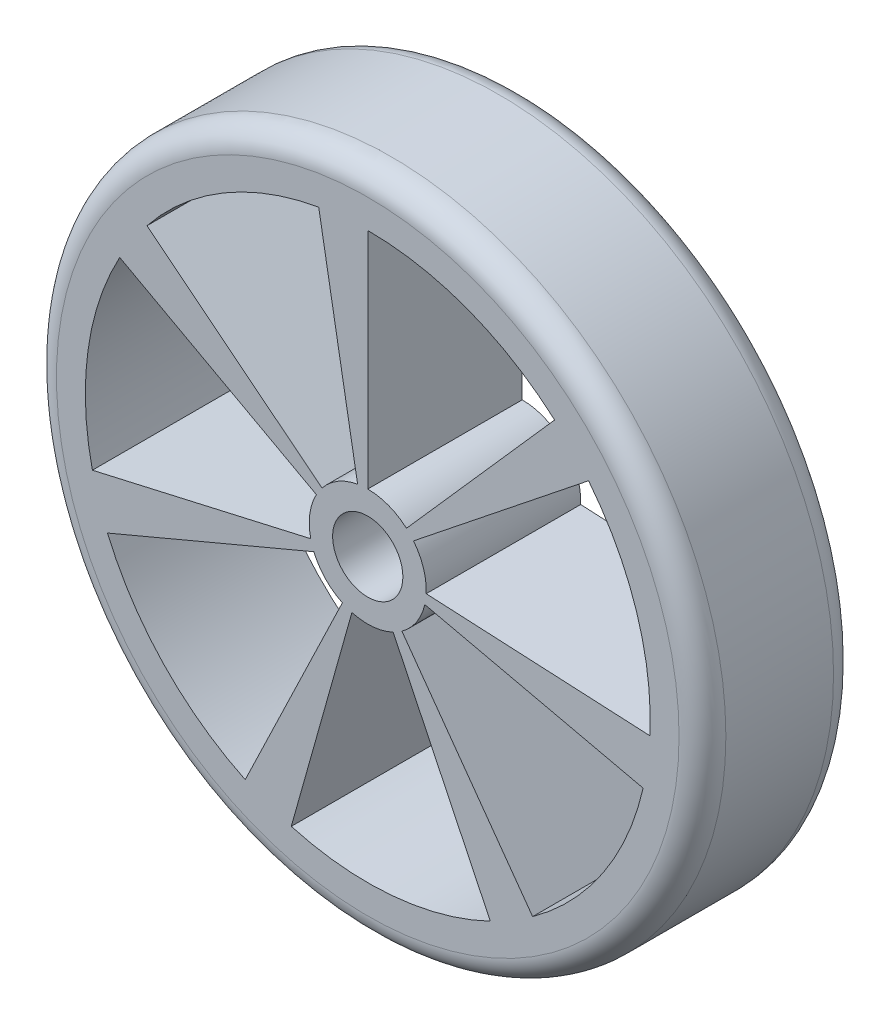
ISO-10303-21;
HEADER;
FILE_DESCRIPTION(('STEP AP214'),'2;1');
FILE_NAME('part.step','',(''),(''),'','','');
FILE_SCHEMA(('AUTOMOTIVE_DESIGN { 1 0 10303 214 1 1 1 1 }'));
ENDSEC;
DATA;
#1=APPLICATION_CONTEXT('core data for automotive mechanical design processes');
#2=APPLICATION_PROTOCOL_DEFINITION('international standard','automotive_design',2000,#1);
#3=PRODUCT_CONTEXT('',#1,'mechanical');
#4=PRODUCT('Part','Part','',(#3));
#5=PRODUCT_RELATED_PRODUCT_CATEGORY('part','',(#4));
#6=PRODUCT_DEFINITION_FORMATION('','',#4);
#7=PRODUCT_DEFINITION_CONTEXT('part definition',#1,'design');
#8=PRODUCT_DEFINITION('design','',#6,#7);
#9=PRODUCT_DEFINITION_SHAPE('','',#8);
#10=(LENGTH_UNIT() NAMED_UNIT(*) SI_UNIT(.MILLI.,.METRE.));
#11=(NAMED_UNIT(*) PLANE_ANGLE_UNIT() SI_UNIT($,.RADIAN.));
#12=(NAMED_UNIT(*) SI_UNIT($,.STERADIAN.) SOLID_ANGLE_UNIT());
#13=UNCERTAINTY_MEASURE_WITH_UNIT(LENGTH_MEASURE(1.E-05),#10,'distance_accuracy_value','');
#14=(GEOMETRIC_REPRESENTATION_CONTEXT(3) GLOBAL_UNCERTAINTY_ASSIGNED_CONTEXT((#13)) GLOBAL_UNIT_ASSIGNED_CONTEXT((#10,
#11,#12)) REPRESENTATION_CONTEXT('',''));
#15=CARTESIAN_POINT('',(0.,0.,0.));
#16=DIRECTION('',(0.,0.,1.));
#17=DIRECTION('',(1.,0.,0.));
#18=AXIS2_PLACEMENT_3D('',#15,#16,#17);
#19=CARTESIAN_POINT('',(0.,0.,6.6));
#20=DIRECTION('',(0.,0.,1.));
#21=DIRECTION('',(1.,0.,0.));
#22=AXIS2_PLACEMENT_3D('',#19,#20,#21);
#23=PLANE('',#22);
#24=CARTESIAN_POINT('',(0.,0.,6.6));
#25=DIRECTION('',(0.,0.,1.));
#26=DIRECTION('',(1.,0.,0.));
#27=AXIS2_PLACEMENT_3D('',#24,#25,#26);
#28=CIRCLE('',#27,1.5);
#29=CARTESIAN_POINT('',(1.5,0.,6.6));
#30=VERTEX_POINT('',#29);
#31=EDGE_CURVE('E909',#30,#30,#28,.T.);
#32=ORIENTED_EDGE('',*,*,#31,.F.);
#33=EDGE_LOOP('',(#32));
#34=FACE_BOUND('',#33,.T.);
#35=CARTESIAN_POINT('',(0.,0.,6.6));
#36=DIRECTION('',(0.,0.,1.));
#37=DIRECTION('',(1.,0.,0.));
#38=AXIS2_PLACEMENT_3D('',#35,#36,#37);
#39=CIRCLE('',#38,13.3);
#40=CARTESIAN_POINT('',(13.3,0.,6.6));
#41=VERTEX_POINT('',#40);
#42=EDGE_CURVE('E595',#41,#41,#39,.T.);
#43=ORIENTED_EDGE('',*,*,#42,.T.);
#44=EDGE_LOOP('',(#43));
#45=FACE_BOUND('',#44,.T.);
#46=DIRECTION('',(-0.173648177666931,0.984807753012208,0.));
#47=VECTOR('',#46,1.);
#48=CARTESIAN_POINT('',(0.,0.,6.6));
#49=LINE('',#48,#47);
#50=CARTESIAN_POINT('',(-0.434120444167328,2.46201938253052,6.6));
#51=VERTEX_POINT('',#50);
#52=CARTESIAN_POINT('',(-2.09542685338494,11.8837562179407,6.6));
#53=VERTEX_POINT('',#52);
#54=EDGE_CURVE('E579',#51,#53,#49,.T.);
#55=ORIENTED_EDGE('',*,*,#54,.F.);
#56=CARTESIAN_POINT('',(0.,0.,6.6));
#57=DIRECTION('',(0.,0.,1.));
#58=DIRECTION('',(1.,0.,0.));
#59=AXIS2_PLACEMENT_3D('',#56,#57,#58);
#60=CIRCLE('',#59,2.5);
#61=CARTESIAN_POINT('',(-1.95457870617006,1.55872450464686,6.6));
#62=VERTEX_POINT('',#61);
#63=EDGE_CURVE('E566',#51,#62,#60,.T.);
#64=ORIENTED_EDGE('',*,*,#63,.T.);
#65=DIRECTION('',(-0.781831482468022,0.623489801858743,0.));
#66=VECTOR('',#65,1.);
#67=CARTESIAN_POINT('',(0.,0.,6.6));
#68=LINE('',#67,#66);
#69=CARTESIAN_POINT('',(-9.43442485372671,7.52370276025801,6.6));
#70=VERTEX_POINT('',#69);
#71=EDGE_CURVE('E587',#62,#70,#68,.T.);
#72=ORIENTED_EDGE('',*,*,#71,.T.);
#73=CARTESIAN_POINT('',(0.,0.,6.6));
#74=DIRECTION('',(0.,0.,1.));
#75=DIRECTION('',(1.,0.,0.));
#76=AXIS2_PLACEMENT_3D('',#73,#74,#75);
#77=CIRCLE('',#76,12.0670823128597);
#78=EDGE_CURVE('E583',#53,#70,#77,.T.);
#79=ORIENTED_EDGE('',*,*,#78,.F.);
#80=EDGE_LOOP('',(#55,#64,#72,#79));
#81=FACE_BOUND('',#80,.T.);
#82=DIRECTION('',(0.998756921218922,-0.0498458856606962,0.));
#83=VECTOR('',#82,1.);
#84=CARTESIAN_POINT('',(0.,0.,6.6));
#85=LINE('',#84,#83);
#86=CARTESIAN_POINT('',(2.49689230304749,-0.12461471415175,6.6));
#87=VERTEX_POINT('',#86);
#88=CARTESIAN_POINT('',(12.0520819788872,-0.601494405225021,6.6));
#89=VERTEX_POINT('',#88);
#90=EDGE_CURVE('E440',#87,#89,#85,.T.);
#91=ORIENTED_EDGE('',*,*,#90,.F.);
#92=CARTESIAN_POINT('',(0.,0.,6.6));
#93=DIRECTION('',(0.,0.,1.));
#94=DIRECTION('',(1.,0.,0.));
#95=AXIS2_PLACEMENT_3D('',#92,#93,#94);
#96=CIRCLE('',#95,2.5);
#97=CARTESIAN_POINT('',(1.95457870617008,1.55872450464683,6.6));
#98=VERTEX_POINT('',#97);
#99=EDGE_CURVE('E432',#87,#98,#96,.T.);
#100=ORIENTED_EDGE('',*,*,#99,.T.);
#101=DIRECTION('',(0.781831482468031,0.623489801858732,0.));
#102=VECTOR('',#101,1.);
#103=CARTESIAN_POINT('',(0.,0.,6.6));
#104=LINE('',#103,#102);
#105=CARTESIAN_POINT('',(9.43442485372682,7.52370276025788,6.6));
#106=VERTEX_POINT('',#105);
#107=EDGE_CURVE('E448',#98,#106,#104,.T.);
#108=ORIENTED_EDGE('',*,*,#107,.T.);
#109=CARTESIAN_POINT('',(0.,0.,6.6));
#110=DIRECTION('',(0.,0.,1.));
#111=DIRECTION('',(1.,0.,0.));
#112=AXIS2_PLACEMENT_3D('',#109,#110,#111);
#113=CIRCLE('',#112,12.0670823128597);
#114=EDGE_CURVE('E444',#89,#106,#113,.T.);
#115=ORIENTED_EDGE('',*,*,#114,.F.);
#116=EDGE_LOOP('',(#91,#100,#108,#115));
#117=FACE_BOUND('',#116,.T.);
#118=DIRECTION('',(0.66168583759686,0.749781202967734,0.));
#119=VECTOR('',#118,1.);
#120=CARTESIAN_POINT('',(0.,0.,6.6));
#121=LINE('',#120,#119);
#122=CARTESIAN_POINT('',(1.65421459399215,1.87445300741933,6.6));
#123=VERTEX_POINT('',#122);
#124=CARTESIAN_POINT('',(7.9846174675348,9.04767149284658,6.6));
#125=VERTEX_POINT('',#124);
#126=EDGE_CURVE('E412',#123,#125,#121,.T.);
#127=ORIENTED_EDGE('',*,*,#126,.F.);
#128=CARTESIAN_POINT('',(0.,0.,6.6));
#129=DIRECTION('',(0.,0.,1.));
#130=DIRECTION('',(1.,0.,0.));
#131=AXIS2_PLACEMENT_3D('',#128,#129,#130);
#132=CIRCLE('',#131,2.5);
#133=CARTESIAN_POINT('',(0.,2.5,6.6));
#134=VERTEX_POINT('',#133);
#135=EDGE_CURVE('E418',#123,#134,#132,.T.);
#136=ORIENTED_EDGE('',*,*,#135,.T.);
#137=DIRECTION('',(0.,1.,0.));
#138=VECTOR('',#137,1.);
#139=CARTESIAN_POINT('',(0.,0.,6.6));
#140=LINE('',#139,#138);
#141=CARTESIAN_POINT('',(0.,12.0670823128597,6.6));
#142=VERTEX_POINT('',#141);
#143=EDGE_CURVE('E422',#134,#142,#140,.T.);
#144=ORIENTED_EDGE('',*,*,#143,.T.);
#145=CARTESIAN_POINT('',(0.,0.,6.6));
#146=DIRECTION('',(0.,0.,1.));
#147=DIRECTION('',(1.,0.,0.));
#148=AXIS2_PLACEMENT_3D('',#145,#146,#147);
#149=CIRCLE('',#148,12.0670823128597);
#150=EDGE_CURVE('E400',#125,#142,#149,.T.);
#151=ORIENTED_EDGE('',*,*,#150,.F.);
#152=EDGE_LOOP('',(#127,#136,#144,#151));
#153=FACE_BOUND('',#152,.T.);
#154=DIRECTION('',(-0.921476211870407,-0.388434796274696,0.));
#155=VECTOR('',#154,1.);
#156=CARTESIAN_POINT('',(0.,0.,6.6));
#157=LINE('',#156,#155);
#158=CARTESIAN_POINT('',(-2.30369052967578,-0.971086990686637,6.6));
#159=VERTEX_POINT('',#158);
#160=CARTESIAN_POINT('',(-11.1195292979821,-4.68727465982552,6.6));
#161=VERTEX_POINT('',#160);
#162=EDGE_CURVE('E521',#159,#161,#157,.T.);
#163=ORIENTED_EDGE('',*,*,#162,.F.);
#164=CARTESIAN_POINT('',(0.,0.,6.6));
#165=DIRECTION('',(0.,0.,1.));
#166=DIRECTION('',(1.,0.,0.));
#167=AXIS2_PLACEMENT_3D('',#164,#165,#166);
#168=CIRCLE('',#167,2.5);
#169=CARTESIAN_POINT('',(-1.0847093477939,-2.25242216975606,6.6));
#170=VERTEX_POINT('',#169);
#171=EDGE_CURVE('E509',#159,#170,#168,.T.);
#172=ORIENTED_EDGE('',*,*,#171,.T.);
#173=DIRECTION('',(-0.433883739117558,-0.900968867902419,0.));
#174=VECTOR('',#173,1.);
#175=CARTESIAN_POINT('',(0.,0.,6.6));
#176=LINE('',#175,#174);
#177=CARTESIAN_POINT('',(-5.23571079414291,-10.8720654903025,6.6));
#178=VERTEX_POINT('',#177);
#179=EDGE_CURVE('E529',#170,#178,#176,.T.);
#180=ORIENTED_EDGE('',*,*,#179,.T.);
#181=CARTESIAN_POINT('',(0.,0.,6.6));
#182=DIRECTION('',(0.,0.,1.));
#183=DIRECTION('',(1.,0.,0.));
#184=AXIS2_PLACEMENT_3D('',#181,#182,#183);
#185=CIRCLE('',#184,12.0670823128597);
#186=EDGE_CURVE('E525',#161,#178,#185,.T.);
#187=ORIENTED_EDGE('',*,*,#186,.F.);
#188=EDGE_LOOP('',(#163,#172,#180,#187));
#189=FACE_BOUND('',#188,.T.);
#190=DIRECTION('',(-0.878221573370223,0.478253978621328,0.));
#191=VECTOR('',#190,1.);
#192=CARTESIAN_POINT('',(0.,0.,6.6));
#193=LINE('',#192,#191);
#194=CARTESIAN_POINT('',(-2.19555393342556,1.19563494655332,6.6));
#195=VERTEX_POINT('',#194);
#196=CARTESIAN_POINT('',(-10.5975720147876,5.77113012647619,6.6));
#197=VERTEX_POINT('',#196);
#198=EDGE_CURVE('E550',#195,#197,#193,.T.);
#199=ORIENTED_EDGE('',*,*,#198,.F.);
#200=CARTESIAN_POINT('',(0.,0.,6.6));
#201=DIRECTION('',(0.,0.,1.));
#202=DIRECTION('',(1.,0.,0.));
#203=AXIS2_PLACEMENT_3D('',#200,#201,#202);
#204=CIRCLE('',#203,2.5);
#205=CARTESIAN_POINT('',(-2.43731978045432,-0.556302334890731,6.6));
#206=VERTEX_POINT('',#205);
#207=EDGE_CURVE('E537',#195,#206,#204,.T.);
#208=ORIENTED_EDGE('',*,*,#207,.T.);
#209=DIRECTION('',(-0.974927912181824,-0.222520933956315,0.));
#210=VECTOR('',#209,1.);
#211=CARTESIAN_POINT('',(0.,0.,6.6));
#212=LINE('',#211,#210);
#213=CARTESIAN_POINT('',(-11.7645353654022,-2.6851784263852,6.6));
#214=VERTEX_POINT('',#213);
#215=EDGE_CURVE('E558',#206,#214,#212,.T.);
#216=ORIENTED_EDGE('',*,*,#215,.T.);
#217=CARTESIAN_POINT('',(0.,0.,6.6));
#218=DIRECTION('',(0.,0.,1.));
#219=DIRECTION('',(1.,0.,0.));
#220=AXIS2_PLACEMENT_3D('',#217,#218,#219);
#221=CIRCLE('',#220,12.0670823128597);
#222=EDGE_CURVE('E554',#197,#214,#221,.T.);
#223=ORIENTED_EDGE('',*,*,#222,.F.);
#224=EDGE_LOOP('',(#199,#208,#216,#223));
#225=FACE_BOUND('',#224,.T.);
#226=DIRECTION('',(0.583743672234791,-0.811938005715856,0.));
#227=VECTOR('',#226,1.);
#228=CARTESIAN_POINT('',(0.,0.,6.6));
#229=LINE('',#228,#227);
#230=CARTESIAN_POINT('',(1.45935918058688,-2.02984501428951,6.6));
#231=VERTEX_POINT('',#230);
#232=CARTESIAN_POINT('',(7.04408294246809,-9.79772274791221,6.6));
#233=VERTEX_POINT('',#232);
#234=EDGE_CURVE('E467',#231,#233,#229,.T.);
#235=ORIENTED_EDGE('',*,*,#234,.F.);
#236=CARTESIAN_POINT('',(0.,0.,6.6));
#237=DIRECTION('',(0.,0.,1.));
#238=DIRECTION('',(1.,0.,0.));
#239=AXIS2_PLACEMENT_3D('',#236,#237,#238);
#240=CIRCLE('',#239,2.5);
#241=CARTESIAN_POINT('',(2.43731978045474,-0.556302334890827,6.6));
#242=VERTEX_POINT('',#241);
#243=EDGE_CURVE('E232',#231,#242,#240,.T.);
#244=ORIENTED_EDGE('',*,*,#243,.T.);
#245=DIRECTION('',(0.974927912181824,-0.222520933956314,0.));
#246=VECTOR('',#245,1.);
#247=CARTESIAN_POINT('',(0.,0.,6.6));
#248=LINE('',#247,#246);
#249=CARTESIAN_POINT('',(11.7645353654027,-2.68517842638529,6.6));
#250=VERTEX_POINT('',#249);
#251=EDGE_CURVE('E475',#242,#250,#248,.T.);
#252=ORIENTED_EDGE('',*,*,#251,.T.);
#253=CARTESIAN_POINT('',(0.,0.,6.6));
#254=DIRECTION('',(0.,0.,1.));
#255=DIRECTION('',(1.,0.,0.));
#256=AXIS2_PLACEMENT_3D('',#253,#254,#255);
#257=CIRCLE('',#256,12.0670823128597);
#258=EDGE_CURVE('E471',#233,#250,#257,.T.);
#259=ORIENTED_EDGE('',*,*,#258,.F.);
#260=EDGE_LOOP('',(#235,#244,#252,#259));
#261=FACE_BOUND('',#260,.T.);
#262=DIRECTION('',(-0.270840468143004,-0.962624246950012,0.));
#263=VECTOR('',#262,1.);
#264=CARTESIAN_POINT('',(0.,0.,6.6));
#265=LINE('',#264,#263);
#266=CARTESIAN_POINT('',(-0.677101170357515,-2.40656061737505,6.6));
#267=VERTEX_POINT('',#266);
#268=CARTESIAN_POINT('',(-3.26825422273508,-11.6160660243004,6.6));
#269=VERTEX_POINT('',#268);
#270=EDGE_CURVE('E493',#267,#269,#265,.T.);
#271=ORIENTED_EDGE('',*,*,#270,.F.);
#272=CARTESIAN_POINT('',(0.,0.,6.6));
#273=DIRECTION('',(0.,0.,1.));
#274=DIRECTION('',(1.,0.,0.));
#275=AXIS2_PLACEMENT_3D('',#272,#273,#274);
#276=CIRCLE('',#275,2.5);
#277=CARTESIAN_POINT('',(1.08470934779383,-2.25242216975591,6.6));
#278=VERTEX_POINT('',#277);
#279=EDGE_CURVE('E224',#267,#278,#276,.T.);
#280=ORIENTED_EDGE('',*,*,#279,.T.);
#281=DIRECTION('',(0.433883739117558,-0.900968867902419,0.));
#282=VECTOR('',#281,1.);
#283=CARTESIAN_POINT('',(0.,0.,6.6));
#284=LINE('',#283,#282);
#285=CARTESIAN_POINT('',(5.23571079414284,-10.8720654903023,6.6));
#286=VERTEX_POINT('',#285);
#287=EDGE_CURVE('E501',#278,#286,#284,.T.);
#288=ORIENTED_EDGE('',*,*,#287,.T.);
#289=CARTESIAN_POINT('',(0.,0.,6.6));
#290=DIRECTION('',(0.,0.,1.));
#291=DIRECTION('',(1.,0.,0.));
#292=AXIS2_PLACEMENT_3D('',#289,#290,#291);
#293=CIRCLE('',#292,12.0670823128597);
#294=EDGE_CURVE('E497',#269,#286,#293,.T.);
#295=ORIENTED_EDGE('',*,*,#294,.F.);
#296=EDGE_LOOP('',(#271,#280,#288,#295));
#297=FACE_BOUND('',#296,.T.);
#298=ADVANCED_FACE('F207',(#34,#45,#81,#117,#153,#189,#225,#261,#297),#23,.T.);
#299=CARTESIAN_POINT('',(0.,0.,0.));
#300=DIRECTION('',(0.,0.,1.));
#301=DIRECTION('',(1.,0.,0.));
#302=AXIS2_PLACEMENT_3D('',#299,#300,#301);
#303=PLANE('',#302);
#304=CARTESIAN_POINT('',(0.,0.,0.));
#305=DIRECTION('',(0.,0.,1.));
#306=DIRECTION('',(1.,0.,0.));
#307=AXIS2_PLACEMENT_3D('',#304,#305,#306);
#308=CIRCLE('',#307,1.5);
#309=CARTESIAN_POINT('',(1.5,0.,0.));
#310=VERTEX_POINT('',#309);
#311=EDGE_CURVE('E211',#310,#310,#308,.T.);
#312=ORIENTED_EDGE('',*,*,#311,.T.);
#313=EDGE_LOOP('',(#312));
#314=FACE_BOUND('',#313,.T.);
#315=CARTESIAN_POINT('',(0.,0.,0.));
#316=DIRECTION('',(0.,0.,1.));
#317=DIRECTION('',(1.,0.,0.));
#318=AXIS2_PLACEMENT_3D('',#315,#316,#317);
#319=CIRCLE('',#318,2.5);
#320=CARTESIAN_POINT('',(1.45935918058688,-2.02984501428951,0.));
#321=VERTEX_POINT('',#320);
#322=CARTESIAN_POINT('',(2.43731978045474,-0.556302334890827,0.));
#323=VERTEX_POINT('',#322);
#324=EDGE_CURVE('E698',#321,#323,#319,.T.);
#325=ORIENTED_EDGE('',*,*,#324,.F.);
#326=DIRECTION('',(0.583743672234791,-0.811938005715856,0.));
#327=VECTOR('',#326,1.);
#328=CARTESIAN_POINT('',(0.,0.,0.));
#329=LINE('',#328,#327);
#330=CARTESIAN_POINT('',(7.04408294246809,-9.79772274791221,0.));
#331=VERTEX_POINT('',#330);
#332=EDGE_CURVE('E687',#321,#331,#329,.T.);
#333=ORIENTED_EDGE('',*,*,#332,.T.);
#334=CARTESIAN_POINT('',(0.,0.,0.));
#335=DIRECTION('',(0.,0.,1.));
#336=DIRECTION('',(1.,0.,0.));
#337=AXIS2_PLACEMENT_3D('',#334,#335,#336);
#338=CIRCLE('',#337,12.0670823128597);
#339=CARTESIAN_POINT('',(11.7645353654027,-2.68517842638529,0.));
#340=VERTEX_POINT('',#339);
#341=EDGE_CURVE('E691',#331,#340,#338,.T.);
#342=ORIENTED_EDGE('',*,*,#341,.T.);
#343=DIRECTION('',(0.974927912181824,-0.222520933956314,0.));
#344=VECTOR('',#343,1.);
#345=CARTESIAN_POINT('',(0.,0.,0.));
#346=LINE('',#345,#344);
#347=EDGE_CURVE('E695',#323,#340,#346,.T.);
#348=ORIENTED_EDGE('',*,*,#347,.F.);
#349=EDGE_LOOP('',(#325,#333,#342,#348));
#350=FACE_BOUND('',#349,.T.);
#351=CARTESIAN_POINT('',(0.,0.,0.));
#352=DIRECTION('',(0.,0.,1.));
#353=DIRECTION('',(1.,0.,0.));
#354=AXIS2_PLACEMENT_3D('',#351,#352,#353);
#355=CIRCLE('',#354,2.5);
#356=CARTESIAN_POINT('',(-2.30369052967578,-0.971086990686638,0.));
#357=VERTEX_POINT('',#356);
#358=CARTESIAN_POINT('',(-1.0847093477939,-2.25242216975606,0.));
#359=VERTEX_POINT('',#358);
#360=EDGE_CURVE('E670',#357,#359,#355,.T.);
#361=ORIENTED_EDGE('',*,*,#360,.F.);
#362=DIRECTION('',(-0.921476211870407,-0.388434796274696,0.));
#363=VECTOR('',#362,1.);
#364=CARTESIAN_POINT('',(0.,0.,0.));
#365=LINE('',#364,#363);
#366=CARTESIAN_POINT('',(-11.1195292979821,-4.68727465982552,0.));
#367=VERTEX_POINT('',#366);
#368=EDGE_CURVE('E659',#357,#367,#365,.T.);
#369=ORIENTED_EDGE('',*,*,#368,.T.);
#370=CARTESIAN_POINT('',(0.,0.,0.));
#371=DIRECTION('',(0.,0.,1.));
#372=DIRECTION('',(1.,0.,0.));
#373=AXIS2_PLACEMENT_3D('',#370,#371,#372);
#374=CIRCLE('',#373,12.0670823128597);
#375=CARTESIAN_POINT('',(-5.23571079414291,-10.8720654903025,0.));
#376=VERTEX_POINT('',#375);
#377=EDGE_CURVE('E663',#367,#376,#374,.T.);
#378=ORIENTED_EDGE('',*,*,#377,.T.);
#379=DIRECTION('',(-0.433883739117558,-0.900968867902419,0.));
#380=VECTOR('',#379,1.);
#381=CARTESIAN_POINT('',(0.,0.,0.));
#382=LINE('',#381,#380);
#383=EDGE_CURVE('E667',#359,#376,#382,.T.);
#384=ORIENTED_EDGE('',*,*,#383,.F.);
#385=EDGE_LOOP('',(#361,#369,#378,#384));
#386=FACE_BOUND('',#385,.T.);
#387=CARTESIAN_POINT('',(0.,0.,0.));
#388=DIRECTION('',(0.,0.,1.));
#389=DIRECTION('',(1.,0.,0.));
#390=AXIS2_PLACEMENT_3D('',#387,#388,#389);
#391=CIRCLE('',#390,2.5);
#392=CARTESIAN_POINT('',(2.49689230304749,-0.12461471415175,0.));
#393=VERTEX_POINT('',#392);
#394=CARTESIAN_POINT('',(1.95457870617008,1.55872450464683,0.));
#395=VERTEX_POINT('',#394);
#396=EDGE_CURVE('E645',#393,#395,#391,.T.);
#397=ORIENTED_EDGE('',*,*,#396,.F.);
#398=DIRECTION('',(0.998756921218922,-0.0498458856606962,0.));
#399=VECTOR('',#398,1.);
#400=CARTESIAN_POINT('',(0.,0.,0.));
#401=LINE('',#400,#399);
#402=CARTESIAN_POINT('',(12.0520819788872,-0.601494405225021,0.));
#403=VERTEX_POINT('',#402);
#404=EDGE_CURVE('E634',#393,#403,#401,.T.);
#405=ORIENTED_EDGE('',*,*,#404,.T.);
#406=CARTESIAN_POINT('',(0.,0.,0.));
#407=DIRECTION('',(0.,0.,1.));
#408=DIRECTION('',(1.,0.,0.));
#409=AXIS2_PLACEMENT_3D('',#406,#407,#408);
#410=CIRCLE('',#409,12.0670823128597);
#411=CARTESIAN_POINT('',(9.43442485372682,7.52370276025788,0.));
#412=VERTEX_POINT('',#411);
#413=EDGE_CURVE('E638',#403,#412,#410,.T.);
#414=ORIENTED_EDGE('',*,*,#413,.T.);
#415=DIRECTION('',(0.781831482468031,0.623489801858732,0.));
#416=VECTOR('',#415,1.);
#417=CARTESIAN_POINT('',(0.,0.,0.));
#418=LINE('',#417,#416);
#419=EDGE_CURVE('E642',#395,#412,#418,.T.);
#420=ORIENTED_EDGE('',*,*,#419,.F.);
#421=EDGE_LOOP('',(#397,#405,#414,#420));
#422=FACE_BOUND('',#421,.T.);
#423=CARTESIAN_POINT('',(0.,0.,0.));
#424=DIRECTION('',(0.,0.,1.));
#425=DIRECTION('',(1.,0.,0.));
#426=AXIS2_PLACEMENT_3D('',#423,#424,#425);
#427=CIRCLE('',#426,13.3);
#428=CARTESIAN_POINT('',(13.3,0.,0.));
#429=VERTEX_POINT('',#428);
#430=EDGE_CURVE('E616',#429,#429,#427,.F.);
#431=ORIENTED_EDGE('',*,*,#430,.T.);
#432=EDGE_LOOP('',(#431));
#433=FACE_BOUND('',#432,.T.);
#434=CARTESIAN_POINT('',(0.,0.,0.));
#435=DIRECTION('',(0.,0.,1.));
#436=DIRECTION('',(1.,0.,0.));
#437=AXIS2_PLACEMENT_3D('',#434,#435,#436);
#438=CIRCLE('',#437,2.5);
#439=CARTESIAN_POINT('',(-0.434120444167328,2.46201938253052,0.));
#440=VERTEX_POINT('',#439);
#441=CARTESIAN_POINT('',(-1.95457870617006,1.55872450464686,0.));
#442=VERTEX_POINT('',#441);
#443=EDGE_CURVE('E631',#440,#442,#438,.T.);
#444=ORIENTED_EDGE('',*,*,#443,.F.);
#445=DIRECTION('',(-0.173648177666931,0.984807753012208,0.));
#446=VECTOR('',#445,1.);
#447=CARTESIAN_POINT('',(0.,0.,0.));
#448=LINE('',#447,#446);
#449=CARTESIAN_POINT('',(-2.09542685338494,11.8837562179407,0.));
#450=VERTEX_POINT('',#449);
#451=EDGE_CURVE('E620',#440,#450,#448,.T.);
#452=ORIENTED_EDGE('',*,*,#451,.T.);
#453=CARTESIAN_POINT('',(0.,0.,0.));
#454=DIRECTION('',(0.,0.,1.));
#455=DIRECTION('',(1.,0.,0.));
#456=AXIS2_PLACEMENT_3D('',#453,#454,#455);
#457=CIRCLE('',#456,12.0670823128597);
#458=CARTESIAN_POINT('',(-9.43442485372671,7.52370276025801,0.));
#459=VERTEX_POINT('',#458);
#460=EDGE_CURVE('E624',#450,#459,#457,.T.);
#461=ORIENTED_EDGE('',*,*,#460,.T.);
#462=DIRECTION('',(-0.781831482468022,0.623489801858743,0.));
#463=VECTOR('',#462,1.);
#464=CARTESIAN_POINT('',(0.,0.,0.));
#465=LINE('',#464,#463);
#466=EDGE_CURVE('E628',#442,#459,#465,.T.);
#467=ORIENTED_EDGE('',*,*,#466,.F.);
#468=EDGE_LOOP('',(#444,#452,#461,#467));
#469=FACE_BOUND('',#468,.T.);
#470=CARTESIAN_POINT('',(0.,0.,0.));
#471=DIRECTION('',(0.,0.,1.));
#472=DIRECTION('',(1.,0.,0.));
#473=AXIS2_PLACEMENT_3D('',#470,#471,#472);
#474=CIRCLE('',#473,2.5);
#475=CARTESIAN_POINT('',(1.65421459399215,1.87445300741933,0.));
#476=VERTEX_POINT('',#475);
#477=CARTESIAN_POINT('',(0.,2.5,0.));
#478=VERTEX_POINT('',#477);
#479=EDGE_CURVE('E656',#476,#478,#474,.T.);
#480=ORIENTED_EDGE('',*,*,#479,.F.);
#481=DIRECTION('',(0.66168583759686,0.749781202967734,0.));
#482=VECTOR('',#481,1.);
#483=CARTESIAN_POINT('',(0.,0.,0.));
#484=LINE('',#483,#482);
#485=CARTESIAN_POINT('',(7.9846174675348,9.04767149284658,0.));
#486=VERTEX_POINT('',#485);
#487=EDGE_CURVE('E648',#476,#486,#484,.T.);
#488=ORIENTED_EDGE('',*,*,#487,.T.);
#489=CARTESIAN_POINT('',(0.,0.,0.));
#490=DIRECTION('',(0.,0.,1.));
#491=DIRECTION('',(1.,0.,0.));
#492=AXIS2_PLACEMENT_3D('',#489,#490,#491);
#493=CIRCLE('',#492,12.0670823128597);
#494=CARTESIAN_POINT('',(0.,12.0670823128597,0.));
#495=VERTEX_POINT('',#494);
#496=EDGE_CURVE('E403',#486,#495,#493,.T.);
#497=ORIENTED_EDGE('',*,*,#496,.T.);
#498=DIRECTION('',(0.,1.,0.));
#499=VECTOR('',#498,1.);
#500=CARTESIAN_POINT('',(0.,0.,0.));
#501=LINE('',#500,#499);
#502=EDGE_CURVE('E653',#478,#495,#501,.T.);
#503=ORIENTED_EDGE('',*,*,#502,.F.);
#504=EDGE_LOOP('',(#480,#488,#497,#503));
#505=FACE_BOUND('',#504,.T.);
#506=CARTESIAN_POINT('',(0.,0.,0.));
#507=DIRECTION('',(0.,0.,1.));
#508=DIRECTION('',(1.,0.,0.));
#509=AXIS2_PLACEMENT_3D('',#506,#507,#508);
#510=CIRCLE('',#509,2.5);
#511=CARTESIAN_POINT('',(-2.19555393342556,1.19563494655332,0.));
#512=VERTEX_POINT('',#511);
#513=CARTESIAN_POINT('',(-2.43731978045432,-0.556302334890731,0.));
#514=VERTEX_POINT('',#513);
#515=EDGE_CURVE('E684',#512,#514,#510,.T.);
#516=ORIENTED_EDGE('',*,*,#515,.F.);
#517=DIRECTION('',(-0.878221573370223,0.478253978621328,0.));
#518=VECTOR('',#517,1.);
#519=CARTESIAN_POINT('',(0.,0.,0.));
#520=LINE('',#519,#518);
#521=CARTESIAN_POINT('',(-10.5975720147876,5.77113012647619,0.));
#522=VERTEX_POINT('',#521);
#523=EDGE_CURVE('E673',#512,#522,#520,.T.);
#524=ORIENTED_EDGE('',*,*,#523,.T.);
#525=CARTESIAN_POINT('',(0.,0.,0.));
#526=DIRECTION('',(0.,0.,1.));
#527=DIRECTION('',(1.,0.,0.));
#528=AXIS2_PLACEMENT_3D('',#525,#526,#527);
#529=CIRCLE('',#528,12.0670823128597);
#530=CARTESIAN_POINT('',(-11.7645353654022,-2.6851784263852,0.));
#531=VERTEX_POINT('',#530);
#532=EDGE_CURVE('E677',#522,#531,#529,.T.);
#533=ORIENTED_EDGE('',*,*,#532,.T.);
#534=DIRECTION('',(-0.974927912181824,-0.222520933956315,0.));
#535=VECTOR('',#534,1.);
#536=CARTESIAN_POINT('',(0.,0.,0.));
#537=LINE('',#536,#535);
#538=EDGE_CURVE('E681',#514,#531,#537,.T.);
#539=ORIENTED_EDGE('',*,*,#538,.F.);
#540=EDGE_LOOP('',(#516,#524,#533,#539));
#541=FACE_BOUND('',#540,.T.);
#542=CARTESIAN_POINT('',(0.,0.,0.));
#543=DIRECTION('',(0.,0.,1.));
#544=DIRECTION('',(1.,0.,0.));
#545=AXIS2_PLACEMENT_3D('',#542,#543,#544);
#546=CIRCLE('',#545,2.5);
#547=CARTESIAN_POINT('',(-0.677101170357515,-2.40656061737505,0.));
#548=VERTEX_POINT('',#547);
#549=CARTESIAN_POINT('',(1.08470934779383,-2.25242216975591,0.));
#550=VERTEX_POINT('',#549);
#551=EDGE_CURVE('E12',#548,#550,#546,.T.);
#552=ORIENTED_EDGE('',*,*,#551,.F.);
#553=DIRECTION('',(-0.270840468143004,-0.962624246950012,0.));
#554=VECTOR('',#553,1.);
#555=CARTESIAN_POINT('',(0.,0.,0.));
#556=LINE('',#555,#554);
#557=CARTESIAN_POINT('',(-3.26825422273508,-11.6160660243004,0.));
#558=VERTEX_POINT('',#557);
#559=EDGE_CURVE('E701',#548,#558,#556,.T.);
#560=ORIENTED_EDGE('',*,*,#559,.T.);
#561=CARTESIAN_POINT('',(0.,0.,0.));
#562=DIRECTION('',(0.,0.,1.));
#563=DIRECTION('',(1.,0.,0.));
#564=AXIS2_PLACEMENT_3D('',#561,#562,#563);
#565=CIRCLE('',#564,12.0670823128597);
#566=CARTESIAN_POINT('',(5.23571079414284,-10.8720654903023,0.));
#567=VERTEX_POINT('',#566);
#568=EDGE_CURVE('E705',#558,#567,#565,.T.);
#569=ORIENTED_EDGE('',*,*,#568,.T.);
#570=DIRECTION('',(0.433883739117558,-0.900968867902419,0.));
#571=VECTOR('',#570,1.);
#572=CARTESIAN_POINT('',(0.,0.,0.));
#573=LINE('',#572,#571);
#574=EDGE_CURVE('E217',#550,#567,#573,.T.);
#575=ORIENTED_EDGE('',*,*,#574,.F.);
#576=EDGE_LOOP('',(#552,#560,#569,#575));
#577=FACE_BOUND('',#576,.T.);
#578=ADVANCED_FACE('F722',(#314,#350,#386,#422,#433,#469,#505,#541,#577),#303,.F.);
#579=CARTESIAN_POINT('',(0.,0.,6.6));
#580=DIRECTION('',(0.,0.,-1.));
#581=DIRECTION('',(-1.,0.,0.));
#582=AXIS2_PLACEMENT_3D('',#579,#580,#581);
#583=CYLINDRICAL_SURFACE('',#582,14.3);
#584=CARTESIAN_POINT('',(0.,0.,1.));
#585=DIRECTION('',(0.,0.,1.));
#586=DIRECTION('',(1.,0.,0.));
#587=AXIS2_PLACEMENT_3D('',#584,#585,#586);
#588=CIRCLE('',#587,14.3);
#589=CARTESIAN_POINT('',(14.3,0.,1.));
#590=VERTEX_POINT('',#589);
#591=EDGE_CURVE('E612',#590,#590,#588,.T.);
#592=ORIENTED_EDGE('',*,*,#591,.T.);
#593=EDGE_LOOP('',(#592));
#594=FACE_BOUND('',#593,.T.);
#595=CARTESIAN_POINT('',(0.,0.,5.6));
#596=DIRECTION('',(0.,0.,1.));
#597=DIRECTION('',(1.,0.,0.));
#598=AXIS2_PLACEMENT_3D('',#595,#596,#597);
#599=CIRCLE('',#598,14.3);
#600=CARTESIAN_POINT('',(14.3,0.,5.6));
#601=VERTEX_POINT('',#600);
#602=EDGE_CURVE('E608',#601,#601,#599,.F.);
#603=ORIENTED_EDGE('',*,*,#602,.T.);
#604=EDGE_LOOP('',(#603));
#605=FACE_BOUND('',#604,.T.);
#606=ADVANCED_FACE('F734',(#594,#605),#583,.T.);
#607=CARTESIAN_POINT('',(0.,0.,5.6));
#608=DIRECTION('',(0.,0.,1.));
#609=DIRECTION('',(1.,0.,0.));
#610=AXIS2_PLACEMENT_3D('',#607,#608,#609);
#611=TOROIDAL_SURFACE('',#610,13.3,1.);
#612=ORIENTED_EDGE('',*,*,#602,.F.);
#613=EDGE_LOOP('',(#612));
#614=FACE_BOUND('',#613,.T.);
#615=ORIENTED_EDGE('',*,*,#42,.F.);
#616=EDGE_LOOP('',(#615));
#617=FACE_BOUND('',#616,.T.);
#618=ADVANCED_FACE('F744',(#614,#617),#611,.T.);
#619=CARTESIAN_POINT('',(0.,0.,1.));
#620=DIRECTION('',(0.,0.,1.));
#621=DIRECTION('',(1.,0.,0.));
#622=AXIS2_PLACEMENT_3D('',#619,#620,#621);
#623=TOROIDAL_SURFACE('',#622,13.3,1.);
#624=ORIENTED_EDGE('',*,*,#430,.F.);
#625=EDGE_LOOP('',(#624));
#626=FACE_BOUND('',#625,.T.);
#627=ORIENTED_EDGE('',*,*,#591,.F.);
#628=EDGE_LOOP('',(#627));
#629=FACE_BOUND('',#628,.T.);
#630=ADVANCED_FACE('F209',(#626,#629),#623,.T.);
#631=CARTESIAN_POINT('',(0.,0.,-3.4));
#632=DIRECTION('',(0.,0.,1.));
#633=DIRECTION('',(1.,0.,0.));
#634=AXIS2_PLACEMENT_3D('',#631,#632,#633);
#635=CYLINDRICAL_SURFACE('',#634,2.5);
#636=ORIENTED_EDGE('',*,*,#443,.T.);
#637=DIRECTION('',(0.,0.,1.));
#638=VECTOR('',#637,1.);
#639=CARTESIAN_POINT('',(-1.95457870617006,1.55872450464686,-3.4));
#640=LINE('',#639,#638);
#641=EDGE_CURVE('E592',#442,#62,#640,.T.);
#642=ORIENTED_EDGE('',*,*,#641,.T.);
#643=ORIENTED_EDGE('',*,*,#63,.F.);
#644=DIRECTION('',(0.,0.,1.));
#645=VECTOR('',#644,1.);
#646=CARTESIAN_POINT('',(-0.434120444167328,2.46201938253052,-3.4));
#647=LINE('',#646,#645);
#648=EDGE_CURVE('E591',#440,#51,#647,.T.);
#649=ORIENTED_EDGE('',*,*,#648,.F.);
#650=EDGE_LOOP('',(#636,#642,#643,#649));
#651=FACE_BOUND('',#650,.T.);
#652=ADVANCED_FACE('F740',(#651),#635,.T.);
#653=CARTESIAN_POINT('',(0.,0.,-3.4));
#654=DIRECTION('',(0.623489801858743,0.781831482468022,0.));
#655=DIRECTION('',(-0.781831482468022,0.623489801858743,0.));
#656=AXIS2_PLACEMENT_3D('',#653,#654,#655);
#657=PLANE('',#656);
#658=ORIENTED_EDGE('',*,*,#466,.T.);
#659=DIRECTION('',(0.,0.,1.));
#660=VECTOR('',#659,1.);
#661=CARTESIAN_POINT('',(-9.43442485372671,7.52370276025801,-3.4));
#662=LINE('',#661,#660);
#663=EDGE_CURVE('E596',#459,#70,#662,.T.);
#664=ORIENTED_EDGE('',*,*,#663,.T.);
#665=ORIENTED_EDGE('',*,*,#71,.F.);
#666=ORIENTED_EDGE('',*,*,#641,.F.);
#667=EDGE_LOOP('',(#658,#664,#665,#666));
#668=FACE_BOUND('',#667,.T.);
#669=ADVANCED_FACE('F848',(#668),#657,.T.);
#670=CARTESIAN_POINT('',(0.,0.,-3.4));
#671=DIRECTION('',(0.,0.,1.));
#672=DIRECTION('',(1.,0.,0.));
#673=AXIS2_PLACEMENT_3D('',#670,#671,#672);
#674=CYLINDRICAL_SURFACE('',#673,12.0670823128597);
#675=DIRECTION('',(0.,0.,1.));
#676=VECTOR('',#675,1.);
#677=CARTESIAN_POINT('',(-2.09542685338494,11.8837562179407,-3.4));
#678=LINE('',#677,#676);
#679=EDGE_CURVE('E599',#450,#53,#678,.T.);
#680=ORIENTED_EDGE('',*,*,#679,.T.);
#681=ORIENTED_EDGE('',*,*,#78,.T.);
#682=ORIENTED_EDGE('',*,*,#663,.F.);
#683=ORIENTED_EDGE('',*,*,#460,.F.);
#684=EDGE_LOOP('',(#680,#681,#682,#683));
#685=FACE_BOUND('',#684,.T.);
#686=ADVANCED_FACE('F851',(#685),#674,.F.);
#687=CARTESIAN_POINT('',(0.,0.,-3.4));
#688=DIRECTION('',(0.984807753012208,0.173648177666931,0.));
#689=DIRECTION('',(-0.173648177666931,0.984807753012208,0.));
#690=AXIS2_PLACEMENT_3D('',#687,#688,#689);
#691=PLANE('',#690);
#692=ORIENTED_EDGE('',*,*,#648,.T.);
#693=ORIENTED_EDGE('',*,*,#54,.T.);
#694=ORIENTED_EDGE('',*,*,#679,.F.);
#695=ORIENTED_EDGE('',*,*,#451,.F.);
#696=EDGE_LOOP('',(#692,#693,#694,#695));
#697=FACE_BOUND('',#696,.T.);
#698=ADVANCED_FACE('F791',(#697),#691,.F.);
#699=CARTESIAN_POINT('',(0.,0.,-3.4));
#700=DIRECTION('',(0.,0.,1.));
#701=DIRECTION('',(1.,0.,0.));
#702=AXIS2_PLACEMENT_3D('',#699,#700,#701);
#703=CYLINDRICAL_SURFACE('',#702,2.5);
#704=ORIENTED_EDGE('',*,*,#396,.T.);
#705=DIRECTION('',(0.,0.,1.));
#706=VECTOR('',#705,1.);
#707=CARTESIAN_POINT('',(1.95457870617008,1.55872450464683,-3.4));
#708=LINE('',#707,#706);
#709=EDGE_CURVE('E453',#395,#98,#708,.T.);
#710=ORIENTED_EDGE('',*,*,#709,.T.);
#711=ORIENTED_EDGE('',*,*,#99,.F.);
#712=DIRECTION('',(0.,0.,1.));
#713=VECTOR('',#712,1.);
#714=CARTESIAN_POINT('',(2.49689230304749,-0.12461471415175,-3.4));
#715=LINE('',#714,#713);
#716=EDGE_CURVE('E452',#393,#87,#715,.T.);
#717=ORIENTED_EDGE('',*,*,#716,.F.);
#718=EDGE_LOOP('',(#704,#710,#711,#717));
#719=FACE_BOUND('',#718,.T.);
#720=ADVANCED_FACE('F767',(#719),#703,.T.);
#721=CARTESIAN_POINT('',(0.,0.,-3.4));
#722=DIRECTION('',(0.623489801858732,-0.781831482468031,0.));
#723=DIRECTION('',(0.781831482468031,0.623489801858732,0.));
#724=AXIS2_PLACEMENT_3D('',#721,#722,#723);
#725=PLANE('',#724);
#726=ORIENTED_EDGE('',*,*,#419,.T.);
#727=DIRECTION('',(0.,0.,1.));
#728=VECTOR('',#727,1.);
#729=CARTESIAN_POINT('',(9.43442485372682,7.52370276025788,-3.4));
#730=LINE('',#729,#728);
#731=EDGE_CURVE('E456',#412,#106,#730,.T.);
#732=ORIENTED_EDGE('',*,*,#731,.T.);
#733=ORIENTED_EDGE('',*,*,#107,.F.);
#734=ORIENTED_EDGE('',*,*,#709,.F.);
#735=EDGE_LOOP('',(#726,#732,#733,#734));
#736=FACE_BOUND('',#735,.T.);
#737=ADVANCED_FACE('F774',(#736),#725,.T.);
#738=CARTESIAN_POINT('',(0.,0.,-3.4));
#739=DIRECTION('',(0.,0.,1.));
#740=DIRECTION('',(1.,0.,0.));
#741=AXIS2_PLACEMENT_3D('',#738,#739,#740);
#742=CYLINDRICAL_SURFACE('',#741,12.0670823128597);
#743=DIRECTION('',(0.,0.,1.));
#744=VECTOR('',#743,1.);
#745=CARTESIAN_POINT('',(12.0520819788872,-0.601494405225021,-3.4));
#746=LINE('',#745,#744);
#747=EDGE_CURVE('E459',#403,#89,#746,.T.);
#748=ORIENTED_EDGE('',*,*,#747,.T.);
#749=ORIENTED_EDGE('',*,*,#114,.T.);
#750=ORIENTED_EDGE('',*,*,#731,.F.);
#751=ORIENTED_EDGE('',*,*,#413,.F.);
#752=EDGE_LOOP('',(#748,#749,#750,#751));
#753=FACE_BOUND('',#752,.T.);
#754=ADVANCED_FACE('F777',(#753),#742,.F.);
#755=CARTESIAN_POINT('',(0.,0.,-3.4));
#756=DIRECTION('',(-0.0498458856606962,-0.998756921218922,0.));
#757=DIRECTION('',(0.998756921218922,-0.0498458856606962,0.));
#758=AXIS2_PLACEMENT_3D('',#755,#756,#757);
#759=PLANE('',#758);
#760=ORIENTED_EDGE('',*,*,#716,.T.);
#761=ORIENTED_EDGE('',*,*,#90,.T.);
#762=ORIENTED_EDGE('',*,*,#747,.F.);
#763=ORIENTED_EDGE('',*,*,#404,.F.);
#764=EDGE_LOOP('',(#760,#761,#762,#763));
#765=FACE_BOUND('',#764,.T.);
#766=ADVANCED_FACE('F762',(#765),#759,.F.);
#767=CARTESIAN_POINT('',(0.,0.,-3.4));
#768=DIRECTION('',(0.,0.,1.));
#769=DIRECTION('',(1.,0.,0.));
#770=AXIS2_PLACEMENT_3D('',#767,#768,#769);
#771=CYLINDRICAL_SURFACE('',#770,2.5);
#772=ORIENTED_EDGE('',*,*,#479,.T.);
#773=DIRECTION('',(0.,0.,1.));
#774=VECTOR('',#773,1.);
#775=CARTESIAN_POINT('',(0.,2.5,-3.4));
#776=LINE('',#775,#774);
#777=EDGE_CURVE('E429',#478,#134,#776,.T.);
#778=ORIENTED_EDGE('',*,*,#777,.T.);
#779=ORIENTED_EDGE('',*,*,#135,.F.);
#780=DIRECTION('',(0.,0.,1.));
#781=VECTOR('',#780,1.);
#782=CARTESIAN_POINT('',(1.65421459399215,1.87445300741933,-3.4));
#783=LINE('',#782,#781);
#784=EDGE_CURVE('E408',#476,#123,#783,.T.);
#785=ORIENTED_EDGE('',*,*,#784,.F.);
#786=EDGE_LOOP('',(#772,#778,#779,#785));
#787=FACE_BOUND('',#786,.T.);
#788=ADVANCED_FACE('F784',(#787),#771,.T.);
#789=CARTESIAN_POINT('',(0.,0.,-3.4));
#790=DIRECTION('',(1.,0.,0.));
#791=DIRECTION('',(0.,0.,-1.));
#792=AXIS2_PLACEMENT_3D('',#789,#790,#791);
#793=PLANE('',#792);
#794=ORIENTED_EDGE('',*,*,#502,.T.);
#795=DIRECTION('',(0.,0.,1.));
#796=VECTOR('',#795,1.);
#797=CARTESIAN_POINT('',(0.,12.0670823128597,-3.4));
#798=LINE('',#797,#796);
#799=EDGE_CURVE('E407',#495,#142,#798,.T.);
#800=ORIENTED_EDGE('',*,*,#799,.T.);
#801=ORIENTED_EDGE('',*,*,#143,.F.);
#802=ORIENTED_EDGE('',*,*,#777,.F.);
#803=EDGE_LOOP('',(#794,#800,#801,#802));
#804=FACE_BOUND('',#803,.T.);
#805=ADVANCED_FACE('F905',(#804),#793,.T.);
#806=CARTESIAN_POINT('',(0.,0.,-3.4));
#807=DIRECTION('',(0.,0.,1.));
#808=DIRECTION('',(1.,0.,0.));
#809=AXIS2_PLACEMENT_3D('',#806,#807,#808);
#810=CYLINDRICAL_SURFACE('',#809,12.0670823128597);
#811=DIRECTION('',(0.,0.,1.));
#812=VECTOR('',#811,1.);
#813=CARTESIAN_POINT('',(7.9846174675348,9.04767149284658,-3.4));
#814=LINE('',#813,#812);
#815=EDGE_CURVE('E395',#486,#125,#814,.T.);
#816=ORIENTED_EDGE('',*,*,#815,.T.);
#817=ORIENTED_EDGE('',*,*,#150,.T.);
#818=ORIENTED_EDGE('',*,*,#799,.F.);
#819=ORIENTED_EDGE('',*,*,#496,.F.);
#820=EDGE_LOOP('',(#816,#817,#818,#819));
#821=FACE_BOUND('',#820,.T.);
#822=ADVANCED_FACE('F397',(#821),#810,.F.);
#823=CARTESIAN_POINT('',(0.,0.,-3.4));
#824=DIRECTION('',(0.749781202967734,-0.66168583759686,0.));
#825=DIRECTION('',(0.66168583759686,0.749781202967734,0.));
#826=AXIS2_PLACEMENT_3D('',#823,#824,#825);
#827=PLANE('',#826);
#828=ORIENTED_EDGE('',*,*,#784,.T.);
#829=ORIENTED_EDGE('',*,*,#126,.T.);
#830=ORIENTED_EDGE('',*,*,#815,.F.);
#831=ORIENTED_EDGE('',*,*,#487,.F.);
#832=EDGE_LOOP('',(#828,#829,#830,#831));
#833=FACE_BOUND('',#832,.T.);
#834=ADVANCED_FACE('F413',(#833),#827,.F.);
#835=CARTESIAN_POINT('',(0.,0.,-3.4));
#836=DIRECTION('',(0.,0.,1.));
#837=DIRECTION('',(1.,0.,0.));
#838=AXIS2_PLACEMENT_3D('',#835,#836,#837);
#839=CYLINDRICAL_SURFACE('',#838,2.5);
#840=ORIENTED_EDGE('',*,*,#360,.T.);
#841=DIRECTION('',(0.,0.,1.));
#842=VECTOR('',#841,1.);
#843=CARTESIAN_POINT('',(-1.0847093477939,-2.25242216975606,-3.4));
#844=LINE('',#843,#842);
#845=EDGE_CURVE('E534',#359,#170,#844,.T.);
#846=ORIENTED_EDGE('',*,*,#845,.T.);
#847=ORIENTED_EDGE('',*,*,#171,.F.);
#848=DIRECTION('',(0.,0.,1.));
#849=VECTOR('',#848,1.);
#850=CARTESIAN_POINT('',(-2.30369052967578,-0.971086990686638,-3.4));
#851=LINE('',#850,#849);
#852=EDGE_CURVE('E533',#357,#159,#851,.T.);
#853=ORIENTED_EDGE('',*,*,#852,.F.);
#854=EDGE_LOOP('',(#840,#846,#847,#853));
#855=FACE_BOUND('',#854,.T.);
#856=ADVANCED_FACE('F821',(#855),#839,.T.);
#857=CARTESIAN_POINT('',(0.,0.,-3.4));
#858=DIRECTION('',(-0.900968867902419,0.433883739117558,0.));
#859=DIRECTION('',(-0.433883739117558,-0.900968867902419,0.));
#860=AXIS2_PLACEMENT_3D('',#857,#858,#859);
#861=PLANE('',#860);
#862=ORIENTED_EDGE('',*,*,#383,.T.);
#863=DIRECTION('',(0.,0.,1.));
#864=VECTOR('',#863,1.);
#865=CARTESIAN_POINT('',(-5.23571079414291,-10.8720654903025,-3.4));
#866=LINE('',#865,#864);
#867=EDGE_CURVE('E538',#376,#178,#866,.T.);
#868=ORIENTED_EDGE('',*,*,#867,.T.);
#869=ORIENTED_EDGE('',*,*,#179,.F.);
#870=ORIENTED_EDGE('',*,*,#845,.F.);
#871=EDGE_LOOP('',(#862,#868,#869,#870));
#872=FACE_BOUND('',#871,.T.);
#873=ADVANCED_FACE('F817',(#872),#861,.T.);
#874=CARTESIAN_POINT('',(0.,0.,-3.4));
#875=DIRECTION('',(0.,0.,1.));
#876=DIRECTION('',(1.,0.,0.));
#877=AXIS2_PLACEMENT_3D('',#874,#875,#876);
#878=CYLINDRICAL_SURFACE('',#877,12.0670823128597);
#879=DIRECTION('',(0.,0.,1.));
#880=VECTOR('',#879,1.);
#881=CARTESIAN_POINT('',(-11.1195292979821,-4.68727465982552,-3.4));
#882=LINE('',#881,#880);
#883=EDGE_CURVE('E541',#367,#161,#882,.T.);
#884=ORIENTED_EDGE('',*,*,#883,.T.);
#885=ORIENTED_EDGE('',*,*,#186,.T.);
#886=ORIENTED_EDGE('',*,*,#867,.F.);
#887=ORIENTED_EDGE('',*,*,#377,.F.);
#888=EDGE_LOOP('',(#884,#885,#886,#887));
#889=FACE_BOUND('',#888,.T.);
#890=ADVANCED_FACE('F820',(#889),#878,.F.);
#891=CARTESIAN_POINT('',(0.,0.,-3.4));
#892=DIRECTION('',(-0.388434796274696,0.921476211870407,0.));
#893=DIRECTION('',(-0.921476211870407,-0.388434796274696,0.));
#894=AXIS2_PLACEMENT_3D('',#891,#892,#893);
#895=PLANE('',#894);
#896=ORIENTED_EDGE('',*,*,#852,.T.);
#897=ORIENTED_EDGE('',*,*,#162,.T.);
#898=ORIENTED_EDGE('',*,*,#883,.F.);
#899=ORIENTED_EDGE('',*,*,#368,.F.);
#900=EDGE_LOOP('',(#896,#897,#898,#899));
#901=FACE_BOUND('',#900,.T.);
#902=ADVANCED_FACE('F825',(#901),#895,.F.);
#903=CARTESIAN_POINT('',(0.,0.,-3.4));
#904=DIRECTION('',(0.,0.,1.));
#905=DIRECTION('',(1.,0.,0.));
#906=AXIS2_PLACEMENT_3D('',#903,#904,#905);
#907=CYLINDRICAL_SURFACE('',#906,2.5);
#908=ORIENTED_EDGE('',*,*,#515,.T.);
#909=DIRECTION('',(0.,0.,1.));
#910=VECTOR('',#909,1.);
#911=CARTESIAN_POINT('',(-2.43731978045432,-0.556302334890731,-3.4));
#912=LINE('',#911,#910);
#913=EDGE_CURVE('E563',#514,#206,#912,.T.);
#914=ORIENTED_EDGE('',*,*,#913,.T.);
#915=ORIENTED_EDGE('',*,*,#207,.F.);
#916=DIRECTION('',(0.,0.,1.));
#917=VECTOR('',#916,1.);
#918=CARTESIAN_POINT('',(-2.19555393342556,1.19563494655332,-3.4));
#919=LINE('',#918,#917);
#920=EDGE_CURVE('E562',#512,#195,#919,.T.);
#921=ORIENTED_EDGE('',*,*,#920,.F.);
#922=EDGE_LOOP('',(#908,#914,#915,#921));
#923=FACE_BOUND('',#922,.T.);
#924=ADVANCED_FACE('F829',(#923),#907,.T.);
#925=CARTESIAN_POINT('',(0.,0.,-3.4));
#926=DIRECTION('',(-0.222520933956315,0.974927912181824,0.));
#927=DIRECTION('',(-0.974927912181824,-0.222520933956315,0.));
#928=AXIS2_PLACEMENT_3D('',#925,#926,#927);
#929=PLANE('',#928);
#930=ORIENTED_EDGE('',*,*,#538,.T.);
#931=DIRECTION('',(0.,0.,1.));
#932=VECTOR('',#931,1.);
#933=CARTESIAN_POINT('',(-11.7645353654022,-2.6851784263852,-3.4));
#934=LINE('',#933,#932);
#935=EDGE_CURVE('E567',#531,#214,#934,.T.);
#936=ORIENTED_EDGE('',*,*,#935,.T.);
#937=ORIENTED_EDGE('',*,*,#215,.F.);
#938=ORIENTED_EDGE('',*,*,#913,.F.);
#939=EDGE_LOOP('',(#930,#936,#937,#938));
#940=FACE_BOUND('',#939,.T.);
#941=ADVANCED_FACE('F834',(#940),#929,.T.);
#942=CARTESIAN_POINT('',(0.,0.,-3.4));
#943=DIRECTION('',(0.,0.,1.));
#944=DIRECTION('',(1.,0.,0.));
#945=AXIS2_PLACEMENT_3D('',#942,#943,#944);
#946=CYLINDRICAL_SURFACE('',#945,12.0670823128597);
#947=DIRECTION('',(0.,0.,1.));
#948=VECTOR('',#947,1.);
#949=CARTESIAN_POINT('',(-10.5975720147876,5.77113012647619,-3.4));
#950=LINE('',#949,#948);
#951=EDGE_CURVE('E570',#522,#197,#950,.T.);
#952=ORIENTED_EDGE('',*,*,#951,.T.);
#953=ORIENTED_EDGE('',*,*,#222,.T.);
#954=ORIENTED_EDGE('',*,*,#935,.F.);
#955=ORIENTED_EDGE('',*,*,#532,.F.);
#956=EDGE_LOOP('',(#952,#953,#954,#955));
#957=FACE_BOUND('',#956,.T.);
#958=ADVANCED_FACE('F837',(#957),#946,.F.);
#959=CARTESIAN_POINT('',(0.,0.,-3.4));
#960=DIRECTION('',(0.478253978621328,0.878221573370223,0.));
#961=DIRECTION('',(-0.878221573370223,0.478253978621328,0.));
#962=AXIS2_PLACEMENT_3D('',#959,#960,#961);
#963=PLANE('',#962);
#964=ORIENTED_EDGE('',*,*,#920,.T.);
#965=ORIENTED_EDGE('',*,*,#198,.T.);
#966=ORIENTED_EDGE('',*,*,#951,.F.);
#967=ORIENTED_EDGE('',*,*,#523,.F.);
#968=EDGE_LOOP('',(#964,#965,#966,#967));
#969=FACE_BOUND('',#968,.T.);
#970=ADVANCED_FACE('F807',(#969),#963,.F.);
#971=CARTESIAN_POINT('',(0.,0.,-3.4));
#972=DIRECTION('',(0.,0.,1.));
#973=DIRECTION('',(1.,0.,0.));
#974=AXIS2_PLACEMENT_3D('',#971,#972,#973);
#975=CYLINDRICAL_SURFACE('',#974,2.5);
#976=ORIENTED_EDGE('',*,*,#324,.T.);
#977=DIRECTION('',(0.,0.,1.));
#978=VECTOR('',#977,1.);
#979=CARTESIAN_POINT('',(2.43731978045474,-0.556302334890827,-3.4));
#980=LINE('',#979,#978);
#981=EDGE_CURVE('E480',#323,#242,#980,.T.);
#982=ORIENTED_EDGE('',*,*,#981,.T.);
#983=ORIENTED_EDGE('',*,*,#243,.F.);
#984=DIRECTION('',(0.,0.,1.));
#985=VECTOR('',#984,1.);
#986=CARTESIAN_POINT('',(1.45935918058688,-2.02984501428951,-3.4));
#987=LINE('',#986,#985);
#988=EDGE_CURVE('E479',#321,#231,#987,.T.);
#989=ORIENTED_EDGE('',*,*,#988,.F.);
#990=EDGE_LOOP('',(#976,#982,#983,#989));
#991=FACE_BOUND('',#990,.T.);
#992=ADVANCED_FACE('F796',(#991),#975,.T.);
#993=CARTESIAN_POINT('',(0.,0.,-3.4));
#994=DIRECTION('',(-0.222520933956314,-0.974927912181824,0.));
#995=DIRECTION('',(0.974927912181824,-0.222520933956314,0.));
#996=AXIS2_PLACEMENT_3D('',#993,#994,#995);
#997=PLANE('',#996);
#998=ORIENTED_EDGE('',*,*,#347,.T.);
#999=DIRECTION('',(0.,0.,1.));
#1000=VECTOR('',#999,1.);
#1001=CARTESIAN_POINT('',(11.7645353654027,-2.68517842638529,-3.4));
#1002=LINE('',#1001,#1000);
#1003=EDGE_CURVE('E483',#340,#250,#1002,.T.);
#1004=ORIENTED_EDGE('',*,*,#1003,.T.);
#1005=ORIENTED_EDGE('',*,*,#251,.F.);
#1006=ORIENTED_EDGE('',*,*,#981,.F.);
#1007=EDGE_LOOP('',(#998,#1004,#1005,#1006));
#1008=FACE_BOUND('',#1007,.T.);
#1009=ADVANCED_FACE('F792',(#1008),#997,.T.);
#1010=CARTESIAN_POINT('',(0.,0.,-3.4));
#1011=DIRECTION('',(0.,0.,1.));
#1012=DIRECTION('',(1.,0.,0.));
#1013=AXIS2_PLACEMENT_3D('',#1010,#1011,#1012);
#1014=CYLINDRICAL_SURFACE('',#1013,12.0670823128597);
#1015=DIRECTION('',(0.,0.,1.));
#1016=VECTOR('',#1015,1.);
#1017=CARTESIAN_POINT('',(7.04408294246809,-9.79772274791221,-3.4));
#1018=LINE('',#1017,#1016);
#1019=EDGE_CURVE('E486',#331,#233,#1018,.T.);
#1020=ORIENTED_EDGE('',*,*,#1019,.T.);
#1021=ORIENTED_EDGE('',*,*,#258,.T.);
#1022=ORIENTED_EDGE('',*,*,#1003,.F.);
#1023=ORIENTED_EDGE('',*,*,#341,.F.);
#1024=EDGE_LOOP('',(#1020,#1021,#1022,#1023));
#1025=FACE_BOUND('',#1024,.T.);
#1026=ADVANCED_FACE('F795',(#1025),#1014,.F.);
#1027=CARTESIAN_POINT('',(0.,0.,-3.4));
#1028=DIRECTION('',(-0.811938005715856,-0.583743672234791,0.));
#1029=DIRECTION('',(0.583743672234791,-0.811938005715856,0.));
#1030=AXIS2_PLACEMENT_3D('',#1027,#1028,#1029);
#1031=PLANE('',#1030);
#1032=ORIENTED_EDGE('',*,*,#988,.T.);
#1033=ORIENTED_EDGE('',*,*,#234,.T.);
#1034=ORIENTED_EDGE('',*,*,#1019,.F.);
#1035=ORIENTED_EDGE('',*,*,#332,.F.);
#1036=EDGE_LOOP('',(#1032,#1033,#1034,#1035));
#1037=FACE_BOUND('',#1036,.T.);
#1038=ADVANCED_FACE('F800',(#1037),#1031,.F.);
#1039=CARTESIAN_POINT('',(0.,0.,-3.4));
#1040=DIRECTION('',(0.,0.,1.));
#1041=DIRECTION('',(1.,0.,0.));
#1042=AXIS2_PLACEMENT_3D('',#1039,#1040,#1041);
#1043=CYLINDRICAL_SURFACE('',#1042,2.5);
#1044=ORIENTED_EDGE('',*,*,#551,.T.);
#1045=DIRECTION('',(0.,0.,1.));
#1046=VECTOR('',#1045,1.);
#1047=CARTESIAN_POINT('',(1.08470934779383,-2.25242216975591,-3.4));
#1048=LINE('',#1047,#1046);
#1049=EDGE_CURVE('E506',#550,#278,#1048,.T.);
#1050=ORIENTED_EDGE('',*,*,#1049,.T.);
#1051=ORIENTED_EDGE('',*,*,#279,.F.);
#1052=DIRECTION('',(0.,0.,1.));
#1053=VECTOR('',#1052,1.);
#1054=CARTESIAN_POINT('',(-0.677101170357515,-2.40656061737505,-3.4));
#1055=LINE('',#1054,#1053);
#1056=EDGE_CURVE('E505',#548,#267,#1055,.T.);
#1057=ORIENTED_EDGE('',*,*,#1056,.F.);
#1058=EDGE_LOOP('',(#1044,#1050,#1051,#1057));
#1059=FACE_BOUND('',#1058,.T.);
#1060=ADVANCED_FACE('F726',(#1059),#1043,.T.);
#1061=CARTESIAN_POINT('',(0.,0.,-3.4));
#1062=DIRECTION('',(-0.900968867902419,-0.433883739117558,0.));
#1063=DIRECTION('',(0.433883739117558,-0.900968867902419,0.));
#1064=AXIS2_PLACEMENT_3D('',#1061,#1062,#1063);
#1065=PLANE('',#1064);
#1066=ORIENTED_EDGE('',*,*,#574,.T.);
#1067=DIRECTION('',(0.,0.,1.));
#1068=VECTOR('',#1067,1.);
#1069=CARTESIAN_POINT('',(5.23571079414284,-10.8720654903023,-3.4));
#1070=LINE('',#1069,#1068);
#1071=EDGE_CURVE('E510',#567,#286,#1070,.T.);
#1072=ORIENTED_EDGE('',*,*,#1071,.T.);
#1073=ORIENTED_EDGE('',*,*,#287,.F.);
#1074=ORIENTED_EDGE('',*,*,#1049,.F.);
#1075=EDGE_LOOP('',(#1066,#1072,#1073,#1074));
#1076=FACE_BOUND('',#1075,.T.);
#1077=ADVANCED_FACE('F714',(#1076),#1065,.T.);
#1078=CARTESIAN_POINT('',(0.,0.,-3.4));
#1079=DIRECTION('',(0.,0.,1.));
#1080=DIRECTION('',(1.,0.,0.));
#1081=AXIS2_PLACEMENT_3D('',#1078,#1079,#1080);
#1082=CYLINDRICAL_SURFACE('',#1081,12.0670823128597);
#1083=DIRECTION('',(0.,0.,1.));
#1084=VECTOR('',#1083,1.);
#1085=CARTESIAN_POINT('',(-3.26825422273508,-11.6160660243004,-3.4));
#1086=LINE('',#1085,#1084);
#1087=EDGE_CURVE('E513',#558,#269,#1086,.T.);
#1088=ORIENTED_EDGE('',*,*,#1087,.T.);
#1089=ORIENTED_EDGE('',*,*,#294,.T.);
#1090=ORIENTED_EDGE('',*,*,#1071,.F.);
#1091=ORIENTED_EDGE('',*,*,#568,.F.);
#1092=EDGE_LOOP('',(#1088,#1089,#1090,#1091));
#1093=FACE_BOUND('',#1092,.T.);
#1094=ADVANCED_FACE('F720',(#1093),#1082,.F.);
#1095=CARTESIAN_POINT('',(0.,0.,-3.4));
#1096=DIRECTION('',(-0.962624246950012,0.270840468143004,0.));
#1097=DIRECTION('',(-0.270840468143004,-0.962624246950012,0.));
#1098=AXIS2_PLACEMENT_3D('',#1095,#1096,#1097);
#1099=PLANE('',#1098);
#1100=ORIENTED_EDGE('',*,*,#1056,.T.);
#1101=ORIENTED_EDGE('',*,*,#270,.T.);
#1102=ORIENTED_EDGE('',*,*,#1087,.F.);
#1103=ORIENTED_EDGE('',*,*,#559,.F.);
#1104=EDGE_LOOP('',(#1100,#1101,#1102,#1103));
#1105=FACE_BOUND('',#1104,.T.);
#1106=ADVANCED_FACE('F724',(#1105),#1099,.F.);
#1107=CARTESIAN_POINT('',(0.,0.,-3.4));
#1108=DIRECTION('',(0.,0.,1.));
#1109=DIRECTION('',(1.,0.,0.));
#1110=AXIS2_PLACEMENT_3D('',#1107,#1108,#1109);
#1111=CYLINDRICAL_SURFACE('',#1110,1.5);
#1112=ORIENTED_EDGE('',*,*,#31,.T.);
#1113=EDGE_LOOP('',(#1112));
#1114=FACE_BOUND('',#1113,.T.);
#1115=ORIENTED_EDGE('',*,*,#311,.F.);
#1116=EDGE_LOOP('',(#1115));
#1117=FACE_BOUND('',#1116,.T.);
#1118=ADVANCED_FACE('F814',(#1114,#1117),#1111,.F.);
#1119=CLOSED_SHELL('',(#298,#578,#606,#618,#630,#652,#669,#686,#698,#720,#737,#754,#766,#788,
#805,#822,#834,#856,#873,#890,#902,#924,#941,#958,#970,#992,#1009,#1026,#1038,#1060,#1077,#1094,
#1106,#1118));
#1120=MANIFOLD_SOLID_BREP('B2',#1119);
#1121=ADVANCED_BREP_SHAPE_REPRESENTATION('',(#18,#1120),#14);
#1122=SHAPE_DEFINITION_REPRESENTATION(#9,#1121);
ENDSEC;
END-ISO-10303-21;
